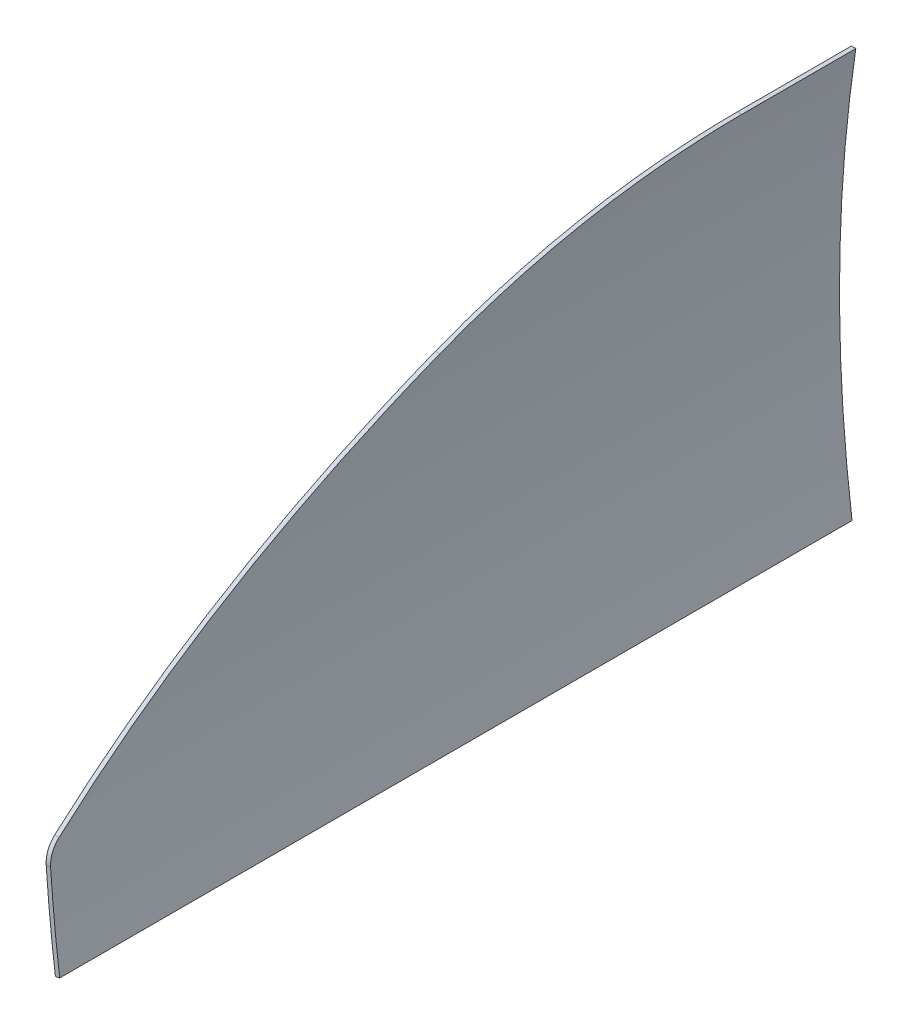
ISO-10303-21;
HEADER;
FILE_DESCRIPTION(('STEP AP214'),'2;1');
FILE_NAME('part.step','',(''),(''),'','','');
FILE_SCHEMA(('AUTOMOTIVE_DESIGN { 1 0 10303 214 1 1 1 1 }'));
ENDSEC;
DATA;
#1=APPLICATION_CONTEXT('core data for automotive mechanical design processes');
#2=APPLICATION_PROTOCOL_DEFINITION('international standard','automotive_design',2000,#1);
#3=PRODUCT_CONTEXT('',#1,'mechanical');
#4=PRODUCT('Part','Part','',(#3));
#5=PRODUCT_RELATED_PRODUCT_CATEGORY('part','',(#4));
#6=PRODUCT_DEFINITION_FORMATION('','',#4);
#7=PRODUCT_DEFINITION_CONTEXT('part definition',#1,'design');
#8=PRODUCT_DEFINITION('design','',#6,#7);
#9=PRODUCT_DEFINITION_SHAPE('','',#8);
#10=(LENGTH_UNIT() NAMED_UNIT(*) SI_UNIT(.MILLI.,.METRE.));
#11=(NAMED_UNIT(*) PLANE_ANGLE_UNIT() SI_UNIT($,.RADIAN.));
#12=(NAMED_UNIT(*) SI_UNIT($,.STERADIAN.) SOLID_ANGLE_UNIT());
#13=UNCERTAINTY_MEASURE_WITH_UNIT(LENGTH_MEASURE(1.E-05),#10,'distance_accuracy_value','');
#14=(GEOMETRIC_REPRESENTATION_CONTEXT(3) GLOBAL_UNCERTAINTY_ASSIGNED_CONTEXT((#13)) GLOBAL_UNIT_ASSIGNED_CONTEXT((#10,
#11,#12)) REPRESENTATION_CONTEXT('',''));
#15=CARTESIAN_POINT('',(0.,0.,0.));
#16=DIRECTION('',(0.,0.,1.));
#17=DIRECTION('',(1.,0.,0.));
#18=AXIS2_PLACEMENT_3D('',#15,#16,#17);
#19=CARTESIAN_POINT('',(1662.91267359414,250.,500.));
#20=DIRECTION('',(0.,0.,-1.));
#21=DIRECTION('',(-1.,0.,0.));
#22=AXIS2_PLACEMENT_3D('',#19,#20,#21);
#23=CYLINDRICAL_SURFACE('',#22,1679.1);
#24=CARTESIAN_POINT('',(1662.91267359414,250.,404.));
#25=DIRECTION('',(0.,0.,1.));
#26=DIRECTION('',(1.,0.,0.));
#27=AXIS2_PLACEMENT_3D('',#24,#25,#26);
#28=CIRCLE('',#27,1679.1);
#29=CARTESIAN_POINT('',(-1.85821629717053,31.1057466023691,404.));
#30=VERTEX_POINT('',#29);
#31=CARTESIAN_POINT('',(-12.2574940213667,135.188330161751,404.));
#32=VERTEX_POINT('',#31);
#33=EDGE_CURVE('E69',#30,#32,#28,.F.);
#34=ORIENTED_EDGE('',*,*,#33,.F.);
#35=DIRECTION('',(0.,0.,1.));
#36=VECTOR('',#35,1.);
#37=CARTESIAN_POINT('',(-1.85821629717053,31.1057466023691,-500.));
#38=LINE('',#37,#36);
#39=CARTESIAN_POINT('',(-1.85821629717053,31.1057466023691,-500.));
#40=VERTEX_POINT('',#39);
#41=EDGE_CURVE('E110',#40,#30,#38,.T.);
#42=ORIENTED_EDGE('',*,*,#41,.F.);
#43=CARTESIAN_POINT('',(1662.91267359414,250.,-500.));
#44=DIRECTION('',(0.,0.,1.));
#45=DIRECTION('',(1.,0.,0.));
#46=AXIS2_PLACEMENT_3D('',#43,#44,#45);
#47=CIRCLE('',#46,1679.1);
#48=CARTESIAN_POINT('',(2.4722179376695,499.628330161751,-500.));
#49=VERTEX_POINT('',#48);
#50=EDGE_CURVE('E61',#40,#49,#47,.F.);
#51=ORIENTED_EDGE('',*,*,#50,.T.);
#52=DIRECTION('',(0.,0.,1.));
#53=VECTOR('',#52,1.);
#54=CARTESIAN_POINT('',(2.4722179376695,499.628330161751,500.));
#55=LINE('',#54,#53);
#56=CARTESIAN_POINT('',(2.4722179376695,499.628330161751,-370.));
#57=VERTEX_POINT('',#56);
#58=EDGE_CURVE('E203',#49,#57,#55,.T.);
#59=ORIENTED_EDGE('',*,*,#58,.T.);
#60=CARTESIAN_POINT('',(-6.9458065284167,425.92460419963,-34.5991617203481));
#61=CARTESIAN_POINT('',(-6.69665422505623,428.289455799148,-39.7201293279682));
#62=CARTESIAN_POINT('',(-6.44814509912683,430.600140181221,-44.8661296534168));
#63=CARTESIAN_POINT('',(-5.95383995624069,435.112203418949,-55.2059611368377));
#64=CARTESIAN_POINT('',(-5.70804394052839,437.313582224469,-60.3997923167466));
#65=CARTESIAN_POINT('',(-5.22058710120033,441.606104214611,-70.8331511283629));
#66=CARTESIAN_POINT('',(-4.97892636085668,443.697245181133,-76.0726796770793));
#67=CARTESIAN_POINT('',(-4.5011069586019,447.768281725359,-86.5949217074381));
#68=CARTESIAN_POINT('',(-4.26494829526287,449.748177331933,-91.8776351778729));
#69=CARTESIAN_POINT('',(-3.56643098544166,455.521918043394,-107.793379311696));
#70=CARTESIAN_POINT('',(-3.11429256666275,459.147536755344,-118.488471315989));
#71=CARTESIAN_POINT('',(-2.24712198400071,465.943039964759,-140.023356894242));
#72=CARTESIAN_POINT('',(-1.83208912227906,469.112933033668,-150.863147742464));
#73=CARTESIAN_POINT('',(-1.0548726973034,474.938422892343,-172.47225093206));
#74=CARTESIAN_POINT('',(-0.691871298106507,477.602260730111,-183.239311186875));
#75=CARTESIAN_POINT('',(-0.0171953739844435,482.480376850164,-204.876803532081));
#76=CARTESIAN_POINT('',(0.294477429150202,484.694640052288,-215.74723907721));
#77=CARTESIAN_POINT('',(0.860236924533955,488.668247349398,-237.565499413399));
#78=CARTESIAN_POINT('',(1.11435833954759,490.427865838209,-248.513273409471));
#79=CARTESIAN_POINT('',(1.56034320955563,493.490542973513,-270.472829099929));
#80=CARTESIAN_POINT('',(1.75221486004451,494.793661722294,-281.484602174044));
#81=CARTESIAN_POINT('',(1.95738850827555,496.179701213508,-295.728081119642));
#82=CARTESIAN_POINT('',(2.00083869214886,496.472639202832,-298.939820124848));
#83=CARTESIAN_POINT('',(2.08210450724497,497.019652066328,-305.366580087286));
#84=CARTESIAN_POINT('',(2.11992035367996,497.273728424889,-308.581600914437));
#85=CARTESIAN_POINT('',(2.22481135626323,497.977538930866,-318.230025533762));
#86=CARTESIAN_POINT('',(2.2833455097172,498.368959189604,-324.667867252615));
#87=CARTESIAN_POINT('',(2.37749551935759,498.997669252438,-337.585551031748));
#88=CARTESIAN_POINT('',(2.41298766087124,499.234127112253,-344.065434177928));
#89=CARTESIAN_POINT('',(2.46036435475485,499.549479026968,-357.030200862375));
#90=CARTESIAN_POINT('',(2.47224496859774,499.628346795023,-363.515085054397));
#91=CARTESIAN_POINT('',(2.4722179376695,499.628330161751,-370.));
#92=B_SPLINE_CURVE_WITH_KNOTS('',3,(#60,#61,#62,#63,#64,#65,#66,#67,#68,#69,#70,#71,#72,#73,#74,
#75,#76,#77,#78,#79,#80,#81,#82,#83,#84,#85,#86,#87,#88,#89,#90,#91),.UNSPECIFIED.,.F.,.F.,(4,2,
2,2,2,2,2,2,2,2,2,2,2,2,2,4),(0.,16.9380846326702,33.8761770340212,50.8146101176378,
67.7530388053932,101.647878235621,135.542080076646,168.82527471867,202.109585600496,
235.373761075662,268.63355537605,278.309500796286,287.985076534121,307.332985956469,
326.783935297484,346.238128886989),.UNSPECIFIED.);
#93=CARTESIAN_POINT('',(-6.9458065284167,425.92460419963,-34.5991617203481));
#94=VERTEX_POINT('',#93);
#95=EDGE_CURVE('E194',#94,#57,#92,.T.);
#96=ORIENTED_EDGE('',*,*,#95,.F.);
#97=CARTESIAN_POINT('',(-13.6875775153225,158.411747589012,392.991389706895));
#98=CARTESIAN_POINT('',(-14.0526604980433,165.095014728516,384.818851780009));
#99=CARTESIAN_POINT('',(-14.3741894513233,171.714468700817,376.592252404173));
#100=CARTESIAN_POINT('',(-14.9347228152785,184.82354667566,360.033583620257));
#101=CARTESIAN_POINT('',(-15.1737279246748,191.313171777011,351.701515105794));
#102=CARTESIAN_POINT('',(-15.5737914896637,204.160127369066,334.934910867642));
#103=CARTESIAN_POINT('',(-15.7348544857563,210.51746554546,326.500381142157));
#104=CARTESIAN_POINT('',(-15.9835965028871,223.098173918881,309.531048813833));
#105=CARTESIAN_POINT('',(-16.0712753699186,229.321543834731,300.996246000595));
#106=CARTESIAN_POINT('',(-16.2305403339362,247.734216196206,275.319992747535));
#107=CARTESIAN_POINT('',(-16.2000296183187,259.722524737032,258.033022289067));
#108=CARTESIAN_POINT('',(-15.9009872164411,283.146739309586,223.091173373515));
#109=CARTESIAN_POINT('',(-15.6324524413265,294.582638170626,205.436290144906));
#110=CARTESIAN_POINT('',(-14.8915988909184,316.889129816982,169.7791494636));
#111=CARTESIAN_POINT('',(-14.4192959396728,327.759766425494,151.776919088559));
#112=CARTESIAN_POINT('',(-13.3041349428485,348.925923713831,115.442257232489));
#113=CARTESIAN_POINT('',(-12.6612763550171,359.221442565041,97.1098247018112));
#114=CARTESIAN_POINT('',(-11.5916576630007,374.247366502559,69.3379216376989));
#115=CARTESIAN_POINT('',(-11.2166229949857,379.196852325935,60.0143072319904));
#116=CARTESIAN_POINT('',(-10.4355944865959,388.947127714602,41.2908091601246));
#117=CARTESIAN_POINT('',(-10.02960061899,393.747917149098,31.8909254268886));
#118=CARTESIAN_POINT('',(-9.19056339639171,403.199499034462,13.0175340798333));
#119=CARTESIAN_POINT('',(-8.7575206256569,407.850294721914,3.54402806012586));
#120=CARTESIAN_POINT('',(-7.86816742590298,417.000928185204,-15.474496926653));
#121=CARTESIAN_POINT('',(-7.4118570623023,421.500766385411,-25.0195156925972));
#122=CARTESIAN_POINT('',(-6.94580652841649,425.92460419963,-34.5991617203481));
#123=B_SPLINE_CURVE_WITH_KNOTS('',3,(#97,#98,#99,#100,#101,#102,#103,#104,#105,#106,#107,#108,
#109,#110,#111,#112,#113,#114,#115,#116,#117,#118,#119,#120,#121,#122),.UNSPECIFIED.,.F.,.F.,(4,
2,2,2,2,2,2,2,2,2,2,2,4),(0.,31.6903050230312,63.3803417208028,95.0685321004802,
126.756788982061,189.854971713458,252.953973286261,316.048075654653,379.142378622431,
410.828963890059,442.515577028968,474.201505972228,505.887345833241),.UNSPECIFIED.);
#124=CARTESIAN_POINT('',(-13.6875775153225,158.411747589012,392.991389706895));
#125=VERTEX_POINT('',#124);
#126=EDGE_CURVE('E172',#125,#94,#123,.T.);
#127=ORIENTED_EDGE('',*,*,#126,.F.);
#128=CARTESIAN_POINT('',(-12.2574940213667,135.188330161751,404.));
#129=CARTESIAN_POINT('',(-12.2864303509859,135.610524856966,404.000000461225));
#130=CARTESIAN_POINT('',(-12.3152033484983,136.032683792228,403.991086522892));
#131=CARTESIAN_POINT('',(-12.3723795026291,136.876264779503,403.955452294848));
#132=CARTESIAN_POINT('',(-12.4007826677193,137.297686848203,403.928732413751));
#133=CARTESIAN_POINT('',(-12.4853616680688,138.559685367766,403.821913287983));
#134=CARTESIAN_POINT('',(-12.5409203534523,139.398188875581,403.71515453871));
#135=CARTESIAN_POINT('',(-12.6499925060041,141.063056240984,403.431283643352));
#136=CARTESIAN_POINT('',(-12.7035066300835,141.88942394433,403.254194306229));
#137=CARTESIAN_POINT('',(-12.7820081314885,143.115428253876,402.936818231514));
#138=CARTESIAN_POINT('',(-12.8078810880648,143.521850268377,402.822398391185));
#139=CARTESIAN_POINT('',(-12.8590142278855,144.329644118176,402.576470713362));
#140=CARTESIAN_POINT('',(-12.8842742524691,144.731014633194,402.44495850625));
#141=CARTESIAN_POINT('',(-12.9591045688719,145.926800879809,402.024973246489));
#142=CARTESIAN_POINT('',(-13.0077016081075,146.712524044109,401.711146657477));
#143=CARTESIAN_POINT('',(-13.1020404921137,148.254802470497,401.018179450907));
#144=CARTESIAN_POINT('',(-13.1477823222455,149.011357583031,400.639038498518));
#145=CARTESIAN_POINT('',(-13.214080157634,150.119809342587,400.023633414351));
#146=CARTESIAN_POINT('',(-13.2357877410823,150.484795843403,399.810783643453));
#147=CARTESIAN_POINT('',(-13.278414448833,151.205381719959,399.369912307869));
#148=CARTESIAN_POINT('',(-13.2993337916973,151.560983689508,399.141894998031));
#149=CARTESIAN_POINT('',(-13.3608843173413,152.61282487253,398.43562509339));
#150=CARTESIAN_POINT('',(-13.4003237306304,153.294362851921,397.935008205251));
#151=CARTESIAN_POINT('',(-13.4615129469372,154.362325531576,397.07884015903));
#152=CARTESIAN_POINT('',(-13.4842945370347,154.762566032009,396.740361341184));
#153=CARTESIAN_POINT('',(-13.5285512291079,155.544809266365,396.042872146603));
#154=CARTESIAN_POINT('',(-13.5500264614183,155.926813818856,395.683863825042));
#155=CARTESIAN_POINT('',(-13.5916281455417,156.671145444289,394.946664158291));
#156=CARTESIAN_POINT('',(-13.6117559204717,157.033491752044,394.568492291312));
#157=CARTESIAN_POINT('',(-13.6506747354486,157.738016724901,393.793587158713));
#158=CARTESIAN_POINT('',(-13.6694654753302,158.080190858401,393.396849758054));
#159=CARTESIAN_POINT('',(-13.6875775153225,158.411747589012,392.991389706895));
#160=B_SPLINE_CURVE_WITH_KNOTS('',3,(#128,#129,#130,#131,#132,#133,#134,#135,#136,#137,#138,
#139,#140,#141,#142,#143,#144,#145,#146,#147,#148,#149,#150,#151,#152,#153,#154,#155,#156,#157,
#158,#159),.UNSPECIFIED.,.F.,.F.,(4,2,2,2,2,2,2,2,2,2,2,2,2,2,2,4),(0.,1.26936796567069,
2.53870680251005,5.07680077410025,7.61407228599208,8.88278287242372,10.1518184415712,
12.6910262003151,15.2302469765906,16.4991318934746,17.7676623476523,20.3038206508079,
21.8772282234229,23.4504785596797,25.0221606911959,26.5941945601457),.UNSPECIFIED.);
#161=EDGE_CURVE('E131',#32,#125,#160,.T.);
#162=ORIENTED_EDGE('',*,*,#161,.F.);
#163=EDGE_LOOP('',(#34,#42,#51,#59,#96,#127,#162));
#164=FACE_BOUND('',#163,.T.);
#165=ADVANCED_FACE('F43',(#164),#23,.F.);
#166=CARTESIAN_POINT('',(1662.91267359414,250.,500.));
#167=DIRECTION('',(0.,0.,-1.));
#168=DIRECTION('',(-1.,0.,0.));
#169=AXIS2_PLACEMENT_3D('',#166,#167,#168);
#170=CYLINDRICAL_SURFACE('',#169,1684.1);
#171=CARTESIAN_POINT('',(1662.91267359414,250.,-500.));
#172=DIRECTION('',(0.,0.,1.));
#173=DIRECTION('',(1.,0.,0.));
#174=AXIS2_PLACEMENT_3D('',#171,#172,#173);
#175=CIRCLE('',#174,1684.1);
#176=CARTESIAN_POINT('',(-6.7806035687441,30.1883301617507,-500.));
#177=VERTEX_POINT('',#176);
#178=CARTESIAN_POINT('',(-2.58380096852528,499.628330161751,-500.));
#179=VERTEX_POINT('',#178);
#180=EDGE_CURVE('E127',#177,#179,#175,.F.);
#181=ORIENTED_EDGE('',*,*,#180,.F.);
#182=DIRECTION('',(0.,0.,-1.));
#183=VECTOR('',#182,1.);
#184=CARTESIAN_POINT('',(-6.7806035687441,30.1883301617507,500.));
#185=LINE('',#184,#183);
#186=CARTESIAN_POINT('',(-6.7806035687441,30.1883301617507,404.));
#187=VERTEX_POINT('',#186);
#188=EDGE_CURVE('E112',#177,#187,#185,.F.);
#189=ORIENTED_EDGE('',*,*,#188,.T.);
#190=CARTESIAN_POINT('',(1662.91267359414,250.,404.));
#191=DIRECTION('',(0.,0.,1.));
#192=DIRECTION('',(1.,0.,0.));
#193=AXIS2_PLACEMENT_3D('',#190,#191,#192);
#194=CIRCLE('',#193,1684.1);
#195=CARTESIAN_POINT('',(-17.2691887258185,135.188330161751,404.));
#196=VERTEX_POINT('',#195);
#197=EDGE_CURVE('E12',#187,#196,#194,.F.);
#198=ORIENTED_EDGE('',*,*,#197,.T.);
#199=CARTESIAN_POINT('',(-17.2691887258185,135.188330161751,404.));
#200=CARTESIAN_POINT('',(-17.2980386030764,135.610522804638,404.000000461543));
#201=CARTESIAN_POINT('',(-17.326725636894,136.03267962108,403.991086609519));
#202=CARTESIAN_POINT('',(-17.3837309692695,136.876256231334,403.955452745514));
#203=CARTESIAN_POINT('',(-17.4120492762758,137.29767604184,403.928733142238));
#204=CARTESIAN_POINT('',(-17.4963755833221,138.559667528155,403.821915170074));
#205=CARTESIAN_POINT('',(-17.5517682778365,139.398166049207,403.715157616705));
#206=CARTESIAN_POINT('',(-17.6605145245861,141.063022378518,403.431290230891));
#207=CARTESIAN_POINT('',(-17.7138687330068,141.889384039979,403.254203250137));
#208=CARTESIAN_POINT('',(-17.7921356511594,143.115378964162,402.936831684554));
#209=CARTESIAN_POINT('',(-17.8179312930374,143.521797799806,402.822413508549));
#210=CARTESIAN_POINT('',(-17.8689116354754,144.329585197265,402.576489507919));
#211=CARTESIAN_POINT('',(-17.8940961778524,144.730952438805,402.444979313855));
#212=CARTESIAN_POINT('',(-17.9687028733519,145.926728516122,402.025000734499));
#213=CARTESIAN_POINT('',(-18.0171546853825,146.712444682599,401.711179389619));
#214=CARTESIAN_POINT('',(-18.1112116625723,148.254709070757,401.018224342528));
#215=CARTESIAN_POINT('',(-18.156816813109,149.011257142603,400.639090304863));
#216=CARTESIAN_POINT('',(-18.2229165717523,150.119698636821,400.02369685552));
#217=CARTESIAN_POINT('',(-18.244559307479,150.484681820997,399.810851135133));
#218=CARTESIAN_POINT('',(-18.2870586826039,151.205261155659,399.369988340947));
#219=CARTESIAN_POINT('',(-18.3079155399107,151.560859899949,399.141975521905));
#220=CARTESIAN_POINT('',(-18.3692822301283,152.612691620429,398.435719750554));
#221=CARTESIAN_POINT('',(-18.4086038662512,153.294223547496,397.93511318287));
#222=CARTESIAN_POINT('',(-18.4696114301195,154.362195266067,397.078948750587));
#223=CARTESIAN_POINT('',(-18.4923259913739,154.762449818049,396.740461739253));
#224=CARTESIAN_POINT('',(-18.5364524316384,155.544719903156,396.042955049399));
#225=CARTESIAN_POINT('',(-18.557864440595,155.926737254858,395.683937426031));
#226=CARTESIAN_POINT('',(-18.5993436052089,156.671093090346,394.946718237319));
#227=CARTESIAN_POINT('',(-18.6194120803722,157.033450813814,394.568536154789));
#228=CARTESIAN_POINT('',(-18.658216192609,157.737997273491,393.793609718593));
#229=CARTESIAN_POINT('',(-18.6769515304192,158.080181478202,393.39686123006));
#230=CARTESIAN_POINT('',(-18.695010147913,158.411747589012,392.991389706895));
#231=B_SPLINE_CURVE_WITH_KNOTS('',3,(#199,#200,#201,#202,#203,#204,#205,#206,#207,#208,#209,
#210,#211,#212,#213,#214,#215,#216,#217,#218,#219,#220,#221,#222,#223,#224,#225,#226,#227,#228,
#229,#230),.UNSPECIFIED.,.F.,.F.,(4,2,2,2,2,2,2,2,2,2,2,2,2,2,2,4),(0.,1.2693441151616,
2.53865909538994,5.07670522118877,7.61392734975939,8.88261326498726,10.1516241498798,
12.6907817628197,15.2299524175547,16.4988126838984,17.7673184917157,20.3034276082294,
21.8768744158896,23.4501639934887,25.0218850363801,26.5939577940011),.UNSPECIFIED.);
#232=CARTESIAN_POINT('',(-18.6950101479129,158.411747589012,392.991389706895));
#233=VERTEX_POINT('',#232);
#234=EDGE_CURVE('E53',#196,#233,#231,.T.);
#235=ORIENTED_EDGE('',*,*,#234,.T.);
#236=CARTESIAN_POINT('',(-18.6950101479129,158.411747589012,392.991389706895));
#237=CARTESIAN_POINT('',(-19.0590059421974,165.095013310755,384.818853435521));
#238=CARTESIAN_POINT('',(-19.3795777885102,171.714460443679,376.5922625533));
#239=CARTESIAN_POINT('',(-19.9384431717419,184.823517383443,360.033620901376));
#240=CARTESIAN_POINT('',(-20.1767374010784,191.313128282502,351.701571019787));
#241=CARTESIAN_POINT('',(-20.5756115570721,204.160053083755,334.935008668439));
#242=CARTESIAN_POINT('',(-20.7361959844722,210.517374627379,326.500502161703));
#243=CARTESIAN_POINT('',(-20.9841993254012,223.09804747527,309.531220979981));
#244=CARTESIAN_POINT('',(-21.0716180863699,229.321398500165,300.99644609596));
#245=CARTESIAN_POINT('',(-21.2304117043605,247.734041780501,275.320241088689));
#246=CARTESIAN_POINT('',(-21.199992881682,259.722338347722,258.033293755944));
#247=CARTESIAN_POINT('',(-20.9018413949271,283.146535568569,223.091483863613));
#248=CARTESIAN_POINT('',(-20.6341056706867,294.582429097039,205.436616562623));
#249=CARTESIAN_POINT('',(-19.8954566431234,316.888927216849,169.779481109527));
#250=CARTESIAN_POINT('',(-19.4245590235788,327.759575371669,151.777239876601));
#251=CARTESIAN_POINT('',(-18.3127183665835,348.925767934325,115.442531831892));
#252=CARTESIAN_POINT('',(-17.6717747907739,359.221310521274,97.110063974797));
#253=CARTESIAN_POINT('',(-16.6053464220672,374.247266325702,69.3381091914475));
#254=CARTESIAN_POINT('',(-16.231431467058,379.196756675552,60.0144886901535));
#255=CARTESIAN_POINT('',(-15.4527361752718,388.947043965024,41.2909722043681));
#256=CARTESIAN_POINT('',(-15.0479558114803,393.7478407745,31.8910761531243));
#257=CARTESIAN_POINT('',(-14.2114279958425,403.199440475927,13.01765279477));
#258=CARTESIAN_POINT('',(-13.7796811228182,407.850246584103,3.54412707190072));
#259=CARTESIAN_POINT('',(-12.8929911857361,417.000902821171,-15.4744431733763));
#260=CARTESIAN_POINT('',(-12.4380481865187,421.500753371973,-25.0194874958036));
#261=CARTESIAN_POINT('',(-11.9733952586683,425.92460419963,-34.5991617203483));
#262=B_SPLINE_CURVE_WITH_KNOTS('',3,(#236,#237,#238,#239,#240,#241,#242,#243,#244,#245,#246,
#247,#248,#249,#250,#251,#252,#253,#254,#255,#256,#257,#258,#259,#260,#261),.UNSPECIFIED.,.F.,
.F.,(4,2,2,2,2,2,2,2,2,2,2,2,4),(0.,31.690186833034,63.3801069668416,95.0681914859438,
126.75634207878,189.854457238723,252.953386050714,316.047444596156,379.141702897296,
410.828191784113,442.514708404305,474.200545123689,505.886293276134),.UNSPECIFIED.);
#263=CARTESIAN_POINT('',(-11.9733952586685,425.92460419963,-34.5991617203481));
#264=VERTEX_POINT('',#263);
#265=EDGE_CURVE('E144',#233,#264,#262,.T.);
#266=ORIENTED_EDGE('',*,*,#265,.T.);
#267=CARTESIAN_POINT('',(-11.9733952586685,425.92460419963,-34.5991617203481));
#268=CARTESIAN_POINT('',(-11.7249826032305,428.289534261498,-39.7202992192848));
#269=CARTESIAN_POINT('',(-11.477211584378,430.600293434025,-44.866470957045));
#270=CARTESIAN_POINT('',(-10.9843754167438,435.112498708392,-55.2066477114232));
#271=CARTESIAN_POINT('',(-10.7393102691941,437.313944760463,-60.4006527498185));
#272=CARTESIAN_POINT('',(-10.2533037923008,441.606593427659,-70.8343609519812));
#273=CARTESIAN_POINT('',(-10.01236254583,443.69779382907,-76.0740650309177));
#274=CARTESIAN_POINT('',(-9.53596673581244,447.768941388827,-86.5966594393715));
#275=CARTESIAN_POINT('',(-9.30051217084658,449.74888857595,-91.8795497577177));
#276=CARTESIAN_POINT('',(-8.60407922721631,455.522770683743,-107.795821771126));
#277=CARTESIAN_POINT('',(-8.15329218105951,459.148467444129,-118.491265955587));
#278=CARTESIAN_POINT('',(-7.2887179889605,465.944095008922,-140.026855078916));
#279=CARTESIAN_POINT('',(-6.87493014761872,469.114034379964,-150.866997293785));
#280=CARTESIAN_POINT('',(-6.10004964455078,474.939587826747,-172.476803767954));
#281=CARTESIAN_POINT('',(-5.73814155831987,477.603443058794,-183.24421613666));
#282=CARTESIAN_POINT('',(-5.06550272324403,482.481563524898,-204.882406764811));
#283=CARTESIAN_POINT('',(-4.75477369104536,484.695813678895,-215.753188478539));
#284=CARTESIAN_POINT('',(-4.19073286068251,488.669365699768,-237.572134795353));
#285=CARTESIAN_POINT('',(-3.93738644800712,490.428941927094,-248.520248617387));
#286=CARTESIAN_POINT('',(-3.49276810966322,493.491506162567,-270.480475935082));
#287=CARTESIAN_POINT('',(-3.30148801279038,494.794554275722,-281.492580811673));
#288=CARTESIAN_POINT('',(-3.09695841018485,496.180442680612,-295.736048574116));
#289=CARTESIAN_POINT('',(-3.05364919660776,496.473317983097,-298.947447772117));
#290=CARTESIAN_POINT('',(-2.97264709858215,497.020213703438,-305.37352663182));
#291=CARTESIAN_POINT('',(-2.9349539996391,497.27423560522,-308.588206163515));
#292=CARTESIAN_POINT('',(-2.83040353097441,497.977895146691,-318.235604937802));
#293=CARTESIAN_POINT('',(-2.77205950474492,498.369231288201,-324.672760107366));
#294=CARTESIAN_POINT('',(-2.67821542833253,498.99780573721,-337.589057219576));
#295=CARTESIAN_POINT('',(-2.6428386682791,499.234212433979,-344.068240221767));
#296=CARTESIAN_POINT('',(-2.59561600897564,499.549496096687,-357.031604802297));
#297=CARTESIAN_POINT('',(-2.58377403579578,499.628346779162,-363.515787034148));
#298=CARTESIAN_POINT('',(-2.58380096852547,499.628330161751,-370.));
#299=B_SPLINE_CURVE_WITH_KNOTS('',3,(#267,#268,#269,#270,#271,#272,#273,#274,#275,#276,#277,
#278,#279,#280,#281,#282,#283,#284,#285,#286,#287,#288,#289,#290,#291,#292,#293,#294,#295,#296,
#297,#298),.UNSPECIFIED.,.F.,.F.,(4,2,2,2,2,2,2,2,2,2,2,2,2,2,2,4),(0.,16.9385476788605,
33.8771030698093,50.8159984547608,67.7548894582471,101.650641035824,135.545755409213,
168.82988000149,202.1151207816,235.380229348293,268.640956691687,278.315864314328,
287.990402331422,307.336236441075,326.785080171984,346.237168084292),.UNSPECIFIED.);
#300=CARTESIAN_POINT('',(-2.58380096852528,499.628330161751,-370.));
#301=VERTEX_POINT('',#300);
#302=EDGE_CURVE('E180',#264,#301,#299,.T.);
#303=ORIENTED_EDGE('',*,*,#302,.T.);
#304=DIRECTION('',(0.,0.,-1.));
#305=VECTOR('',#304,1.);
#306=CARTESIAN_POINT('',(-2.58380096852528,499.628330161751,500.));
#307=LINE('',#306,#305);
#308=EDGE_CURVE('E206',#301,#179,#307,.T.);
#309=ORIENTED_EDGE('',*,*,#308,.T.);
#310=EDGE_LOOP('',(#181,#189,#198,#235,#266,#303,#309));
#311=FACE_BOUND('',#310,.T.);
#312=ADVANCED_FACE('F151',(#311),#170,.T.);
#313=CARTESIAN_POINT('',(1662.91267359414,250.,-500.));
#314=DIRECTION('',(0.,0.,1.));
#315=DIRECTION('',(1.,0.,0.));
#316=AXIS2_PLACEMENT_3D('',#313,#314,#315);
#317=PLANE('',#316);
#318=ORIENTED_EDGE('',*,*,#50,.F.);
#319=DIRECTION('',(-0.983071696061995,-0.183221288069353,0.));
#320=VECTOR('',#319,1.);
#321=CARTESIAN_POINT('',(-6.7806035687441,30.1883301617507,-500.));
#322=LINE('',#321,#320);
#323=EDGE_CURVE('E108',#40,#177,#322,.T.);
#324=ORIENTED_EDGE('',*,*,#323,.T.);
#325=ORIENTED_EDGE('',*,*,#180,.T.);
#326=DIRECTION('',(-1.,0.,0.));
#327=VECTOR('',#326,1.);
#328=CARTESIAN_POINT('',(1662.91267359414,499.628330161751,-500.));
#329=LINE('',#328,#327);
#330=EDGE_CURVE('E125',#49,#179,#329,.T.);
#331=ORIENTED_EDGE('',*,*,#330,.F.);
#332=EDGE_LOOP('',(#318,#324,#325,#331));
#333=FACE_BOUND('',#332,.T.);
#334=ADVANCED_FACE('F124',(#333),#317,.F.);
#335=CARTESIAN_POINT('',(-40.,30.1883301617507,404.));
#336=DIRECTION('',(0.,0.,1.));
#337=DIRECTION('',(1.,0.,0.));
#338=AXIS2_PLACEMENT_3D('',#335,#336,#337);
#339=PLANE('',#338);
#340=DIRECTION('',(-0.983071696061995,-0.183221288069353,0.));
#341=VECTOR('',#340,1.);
#342=CARTESIAN_POINT('',(-6.7806035687441,30.1883301617507,404.));
#343=LINE('',#342,#341);
#344=EDGE_CURVE('E117',#30,#187,#343,.T.);
#345=ORIENTED_EDGE('',*,*,#344,.F.);
#346=ORIENTED_EDGE('',*,*,#33,.T.);
#347=DIRECTION('',(1.,0.,0.));
#348=VECTOR('',#347,1.);
#349=CARTESIAN_POINT('',(-40.,135.188330161751,404.));
#350=LINE('',#349,#348);
#351=EDGE_CURVE('E210',#196,#32,#350,.T.);
#352=ORIENTED_EDGE('',*,*,#351,.F.);
#353=ORIENTED_EDGE('',*,*,#197,.F.);
#354=EDGE_LOOP('',(#345,#346,#352,#353));
#355=FACE_BOUND('',#354,.T.);
#356=ADVANCED_FACE('F159',(#355),#339,.T.);
#357=CARTESIAN_POINT('',(-40.,135.188330161751,374.));
#358=DIRECTION('',(1.,0.,0.));
#359=DIRECTION('',(0.,0.,-1.));
#360=AXIS2_PLACEMENT_3D('',#357,#358,#359);
#361=CYLINDRICAL_SURFACE('',#360,29.9999999999999);
#362=ORIENTED_EDGE('',*,*,#161,.T.);
#363=DIRECTION('',(1.,0.,0.));
#364=VECTOR('',#363,1.);
#365=CARTESIAN_POINT('',(-40.,158.411747589012,392.991389706895));
#366=LINE('',#365,#364);
#367=EDGE_CURVE('E218',#233,#125,#366,.T.);
#368=ORIENTED_EDGE('',*,*,#367,.F.);
#369=ORIENTED_EDGE('',*,*,#234,.F.);
#370=ORIENTED_EDGE('',*,*,#351,.T.);
#371=EDGE_LOOP('',(#362,#368,#369,#370));
#372=FACE_BOUND('',#371,.T.);
#373=ADVANCED_FACE('F154',(#372),#361,.T.);
#374=CARTESIAN_POINT('',(-40.,-1389.81608089507,-873.101257419478));
#375=DIRECTION('',(1.,0.,0.));
#376=DIRECTION('',(0.,0.,-1.));
#377=AXIS2_PLACEMENT_3D('',#374,#375,#376);
#378=CYLINDRICAL_SURFACE('',#377,2000.);
#379=ORIENTED_EDGE('',*,*,#126,.T.);
#380=DIRECTION('',(1.,0.,0.));
#381=VECTOR('',#380,1.);
#382=CARTESIAN_POINT('',(-40.,425.92460419963,-34.5991617203481));
#383=LINE('',#382,#381);
#384=EDGE_CURVE('E214',#264,#94,#383,.T.);
#385=ORIENTED_EDGE('',*,*,#384,.F.);
#386=ORIENTED_EDGE('',*,*,#265,.F.);
#387=ORIENTED_EDGE('',*,*,#367,.T.);
#388=EDGE_LOOP('',(#379,#385,#386,#387));
#389=FACE_BOUND('',#388,.T.);
#390=ADVANCED_FACE('F158',(#389),#378,.T.);
#391=CARTESIAN_POINT('',(-40.,-300.371669838249,-370.));
#392=DIRECTION('',(1.,0.,0.));
#393=DIRECTION('',(0.,0.,-1.));
#394=AXIS2_PLACEMENT_3D('',#391,#392,#393);
#395=CYLINDRICAL_SURFACE('',#394,800.);
#396=ORIENTED_EDGE('',*,*,#95,.T.);
#397=DIRECTION('',(1.,0.,0.));
#398=VECTOR('',#397,1.);
#399=CARTESIAN_POINT('',(-40.,499.628330161751,-370.));
#400=LINE('',#399,#398);
#401=EDGE_CURVE('E121',#301,#57,#400,.T.);
#402=ORIENTED_EDGE('',*,*,#401,.F.);
#403=ORIENTED_EDGE('',*,*,#302,.F.);
#404=ORIENTED_EDGE('',*,*,#384,.T.);
#405=EDGE_LOOP('',(#396,#402,#403,#404));
#406=FACE_BOUND('',#405,.T.);
#407=ADVANCED_FACE('F187',(#406),#395,.T.);
#408=CARTESIAN_POINT('',(-40.,499.628330161751,-500.));
#409=DIRECTION('',(0.,1.,0.));
#410=DIRECTION('',(0.,0.,1.));
#411=AXIS2_PLACEMENT_3D('',#408,#409,#410);
#412=PLANE('',#411);
#413=ORIENTED_EDGE('',*,*,#330,.T.);
#414=ORIENTED_EDGE('',*,*,#308,.F.);
#415=ORIENTED_EDGE('',*,*,#401,.T.);
#416=ORIENTED_EDGE('',*,*,#58,.F.);
#417=EDGE_LOOP('',(#413,#414,#415,#416));
#418=FACE_BOUND('',#417,.T.);
#419=ADVANCED_FACE('F191',(#418),#412,.T.);
#420=CARTESIAN_POINT('',(-6.7806035687441,30.1883301617507,-500.));
#421=DIRECTION('',(-0.183221288069353,0.983071696061995,0.));
#422=DIRECTION('',(-0.983071696061995,-0.183221288069353,0.));
#423=AXIS2_PLACEMENT_3D('',#420,#421,#422);
#424=PLANE('',#423);
#425=ORIENTED_EDGE('',*,*,#344,.T.);
#426=ORIENTED_EDGE('',*,*,#188,.F.);
#427=ORIENTED_EDGE('',*,*,#323,.F.);
#428=ORIENTED_EDGE('',*,*,#41,.T.);
#429=EDGE_LOOP('',(#425,#426,#427,#428));
#430=FACE_BOUND('',#429,.T.);
#431=ADVANCED_FACE('F109',(#430),#424,.F.);
#432=CLOSED_SHELL('',(#165,#312,#334,#356,#373,#390,#407,#419,#431));
#433=MANIFOLD_SOLID_BREP('B2',#432);
#434=ADVANCED_BREP_SHAPE_REPRESENTATION('',(#18,#433),#14);
#435=SHAPE_DEFINITION_REPRESENTATION(#9,#434);
ENDSEC;
END-ISO-10303-21;
